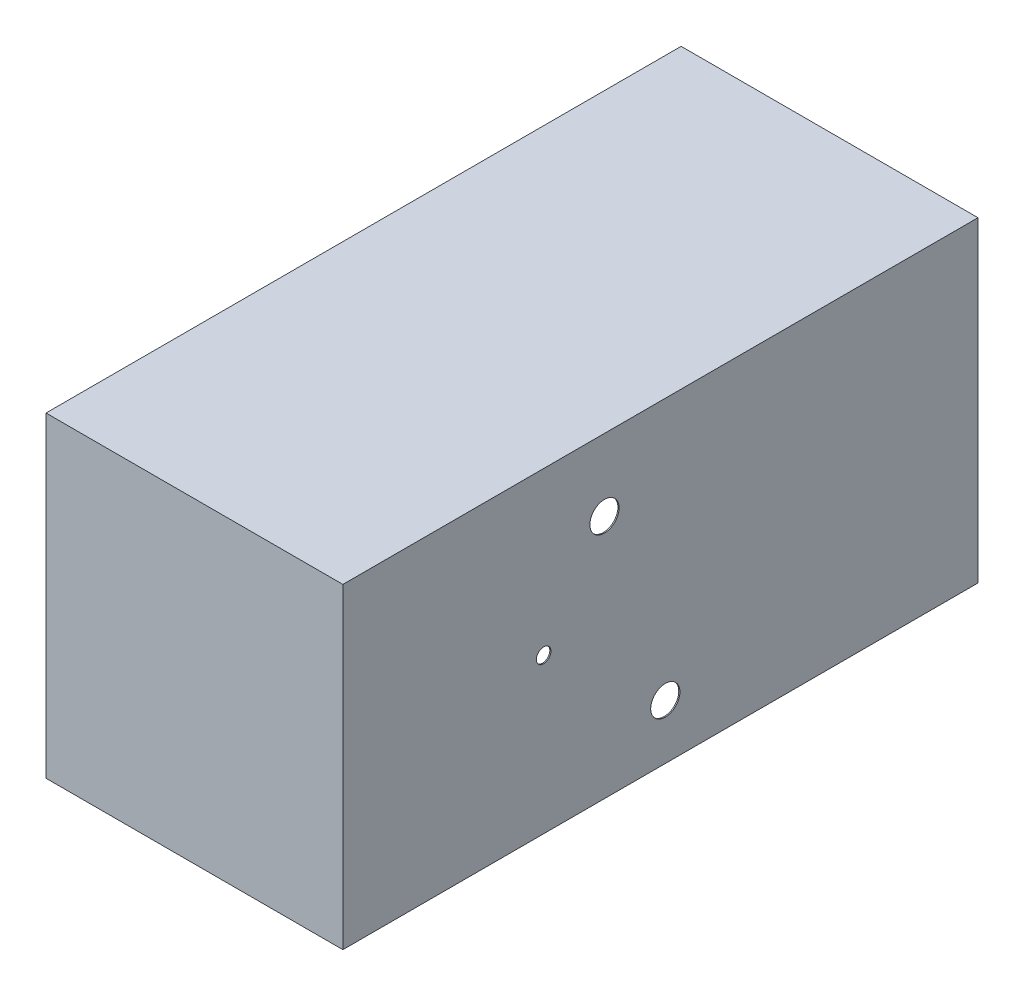
ISO-10303-21;
HEADER;
FILE_DESCRIPTION(('STEP AP214'),'2;1');
FILE_NAME('part.step','',(''),(''),'','','');
FILE_SCHEMA(('AUTOMOTIVE_DESIGN { 1 0 10303 214 1 1 1 1 }'));
ENDSEC;
DATA;
#1=APPLICATION_CONTEXT('core data for automotive mechanical design processes');
#2=APPLICATION_PROTOCOL_DEFINITION('international standard','automotive_design',2000,#1);
#3=PRODUCT_CONTEXT('',#1,'mechanical');
#4=PRODUCT('Part','Part','',(#3));
#5=PRODUCT_RELATED_PRODUCT_CATEGORY('part','',(#4));
#6=PRODUCT_DEFINITION_FORMATION('','',#4);
#7=PRODUCT_DEFINITION_CONTEXT('part definition',#1,'design');
#8=PRODUCT_DEFINITION('design','',#6,#7);
#9=PRODUCT_DEFINITION_SHAPE('','',#8);
#10=(LENGTH_UNIT() NAMED_UNIT(*) SI_UNIT(.MILLI.,.METRE.));
#11=(NAMED_UNIT(*) PLANE_ANGLE_UNIT() SI_UNIT($,.RADIAN.));
#12=(NAMED_UNIT(*) SI_UNIT($,.STERADIAN.) SOLID_ANGLE_UNIT());
#13=UNCERTAINTY_MEASURE_WITH_UNIT(LENGTH_MEASURE(1.E-05),#10,'distance_accuracy_value','');
#14=(GEOMETRIC_REPRESENTATION_CONTEXT(3) GLOBAL_UNCERTAINTY_ASSIGNED_CONTEXT((#13)) GLOBAL_UNIT_ASSIGNED_CONTEXT((#10,
#11,#12)) REPRESENTATION_CONTEXT('',''));
#15=CARTESIAN_POINT('',(0.,0.,0.));
#16=DIRECTION('',(0.,0.,1.));
#17=DIRECTION('',(1.,0.,0.));
#18=AXIS2_PLACEMENT_3D('',#15,#16,#17);
#19=CARTESIAN_POINT('',(0.,640.,-652.5));
#20=DIRECTION('',(0.,0.,1.));
#21=DIRECTION('',(1.,0.,0.));
#22=AXIS2_PLACEMENT_3D('',#19,#20,#21);
#23=PLANE('',#22);
#24=DIRECTION('',(-1.,0.,0.));
#25=VECTOR('',#24,1.);
#26=CARTESIAN_POINT('',(0.,0.,-652.5));
#27=LINE('',#26,#25);
#28=CARTESIAN_POINT('',(305.,0.,-652.5));
#29=VERTEX_POINT('',#28);
#30=CARTESIAN_POINT('',(-305.,0.,-652.5));
#31=VERTEX_POINT('',#30);
#32=EDGE_CURVE('E199',#29,#31,#27,.T.);
#33=ORIENTED_EDGE('',*,*,#32,.T.);
#34=DIRECTION('',(0.,-1.,0.));
#35=VECTOR('',#34,1.);
#36=CARTESIAN_POINT('',(-305.,640.,-652.5));
#37=LINE('',#36,#35);
#38=CARTESIAN_POINT('',(-305.,650.,-652.5));
#39=VERTEX_POINT('',#38);
#40=EDGE_CURVE('E11',#39,#31,#37,.T.);
#41=ORIENTED_EDGE('',*,*,#40,.F.);
#42=DIRECTION('',(-1.,0.,0.));
#43=VECTOR('',#42,1.);
#44=CARTESIAN_POINT('',(305.,650.,-652.5));
#45=LINE('',#44,#43);
#46=CARTESIAN_POINT('',(305.,650.,-652.5));
#47=VERTEX_POINT('',#46);
#48=EDGE_CURVE('E135',#47,#39,#45,.T.);
#49=ORIENTED_EDGE('',*,*,#48,.F.);
#50=DIRECTION('',(0.,-1.,0.));
#51=VECTOR('',#50,1.);
#52=CARTESIAN_POINT('',(305.,640.,-652.5));
#53=LINE('',#52,#51);
#54=EDGE_CURVE('E97',#47,#29,#53,.T.);
#55=ORIENTED_EDGE('',*,*,#54,.T.);
#56=EDGE_LOOP('',(#33,#41,#49,#55));
#57=FACE_BOUND('',#56,.T.);
#58=ADVANCED_FACE('F41',(#57),#23,.F.);
#59=CARTESIAN_POINT('',(-305.,640.,0.));
#60=DIRECTION('',(1.,0.,0.));
#61=DIRECTION('',(0.,0.,-1.));
#62=AXIS2_PLACEMENT_3D('',#59,#60,#61);
#63=PLANE('',#62);
#64=CARTESIAN_POINT('',(-305.,502.5,115.));
#65=DIRECTION('',(1.,0.,0.));
#66=DIRECTION('',(0.,0.,-1.));
#67=AXIS2_PLACEMENT_3D('',#64,#65,#66);
#68=CIRCLE('',#67,30.);
#69=CARTESIAN_POINT('',(-305.,502.5,85.0000000000001));
#70=VERTEX_POINT('',#69);
#71=EDGE_CURVE('E173',#70,#70,#68,.T.);
#72=ORIENTED_EDGE('',*,*,#71,.T.);
#73=EDGE_LOOP('',(#72));
#74=FACE_BOUND('',#73,.T.);
#75=CARTESIAN_POINT('',(-305.,112.5,-9.99999999999994));
#76=DIRECTION('',(1.,0.,0.));
#77=DIRECTION('',(0.,0.,-1.));
#78=AXIS2_PLACEMENT_3D('',#75,#76,#77);
#79=CIRCLE('',#78,30.);
#80=CARTESIAN_POINT('',(-305.,112.5,-39.9999999999999));
#81=VERTEX_POINT('',#80);
#82=EDGE_CURVE('E164',#81,#81,#79,.T.);
#83=ORIENTED_EDGE('',*,*,#82,.T.);
#84=EDGE_LOOP('',(#83));
#85=FACE_BOUND('',#84,.T.);
#86=CARTESIAN_POINT('',(-305.,317.5,240.));
#87=DIRECTION('',(1.,0.,0.));
#88=DIRECTION('',(0.,0.,-1.));
#89=AXIS2_PLACEMENT_3D('',#86,#87,#88);
#90=CIRCLE('',#89,15.);
#91=CARTESIAN_POINT('',(-305.,317.5,225.));
#92=VERTEX_POINT('',#91);
#93=EDGE_CURVE('E155',#92,#92,#90,.T.);
#94=ORIENTED_EDGE('',*,*,#93,.T.);
#95=EDGE_LOOP('',(#94));
#96=FACE_BOUND('',#95,.T.);
#97=DIRECTION('',(0.,0.,1.));
#98=VECTOR('',#97,1.);
#99=CARTESIAN_POINT('',(-305.,0.,0.));
#100=LINE('',#99,#98);
#101=CARTESIAN_POINT('',(-305.,0.,652.5));
#102=VERTEX_POINT('',#101);
#103=EDGE_CURVE('E122',#31,#102,#100,.T.);
#104=ORIENTED_EDGE('',*,*,#103,.T.);
#105=DIRECTION('',(0.,-1.,0.));
#106=VECTOR('',#105,1.);
#107=CARTESIAN_POINT('',(-305.,640.,652.5));
#108=LINE('',#107,#106);
#109=CARTESIAN_POINT('',(-305.,650.,652.5));
#110=VERTEX_POINT('',#109);
#111=EDGE_CURVE('E51',#110,#102,#108,.T.);
#112=ORIENTED_EDGE('',*,*,#111,.F.);
#113=DIRECTION('',(0.,0.,1.));
#114=VECTOR('',#113,1.);
#115=CARTESIAN_POINT('',(-305.,650.,-652.5));
#116=LINE('',#115,#114);
#117=EDGE_CURVE('E121',#39,#110,#116,.T.);
#118=ORIENTED_EDGE('',*,*,#117,.F.);
#119=ORIENTED_EDGE('',*,*,#40,.T.);
#120=EDGE_LOOP('',(#104,#112,#118,#119));
#121=FACE_BOUND('',#120,.T.);
#122=ADVANCED_FACE('F119',(#74,#85,#96,#121),#63,.F.);
#123=CARTESIAN_POINT('',(0.,640.,652.5));
#124=DIRECTION('',(0.,0.,1.));
#125=DIRECTION('',(1.,0.,0.));
#126=AXIS2_PLACEMENT_3D('',#123,#124,#125);
#127=PLANE('',#126);
#128=DIRECTION('',(-1.,0.,0.));
#129=VECTOR('',#128,1.);
#130=CARTESIAN_POINT('',(0.,0.,652.5));
#131=LINE('',#130,#129);
#132=CARTESIAN_POINT('',(305.,0.,652.5));
#133=VERTEX_POINT('',#132);
#134=EDGE_CURVE('E202',#133,#102,#131,.T.);
#135=ORIENTED_EDGE('',*,*,#134,.F.);
#136=DIRECTION('',(0.,-1.,0.));
#137=VECTOR('',#136,1.);
#138=CARTESIAN_POINT('',(305.,640.,652.5));
#139=LINE('',#138,#137);
#140=CARTESIAN_POINT('',(305.,650.,652.5));
#141=VERTEX_POINT('',#140);
#142=EDGE_CURVE('E90',#141,#133,#139,.T.);
#143=ORIENTED_EDGE('',*,*,#142,.F.);
#144=DIRECTION('',(1.,0.,0.));
#145=VECTOR('',#144,1.);
#146=CARTESIAN_POINT('',(305.,650.,652.5));
#147=LINE('',#146,#145);
#148=EDGE_CURVE('E127',#110,#141,#147,.T.);
#149=ORIENTED_EDGE('',*,*,#148,.F.);
#150=ORIENTED_EDGE('',*,*,#111,.T.);
#151=EDGE_LOOP('',(#135,#143,#149,#150));
#152=FACE_BOUND('',#151,.T.);
#153=ADVANCED_FACE('F128',(#152),#127,.T.);
#154=CARTESIAN_POINT('',(-302.662835249042,640.,0.));
#155=DIRECTION('',(1.,0.,0.));
#156=DIRECTION('',(0.,0.,-1.));
#157=AXIS2_PLACEMENT_3D('',#154,#155,#156);
#158=PLANE('',#157);
#159=CARTESIAN_POINT('',(-302.662835249042,502.5,115.));
#160=DIRECTION('',(1.,0.,0.));
#161=DIRECTION('',(0.,0.,-1.));
#162=AXIS2_PLACEMENT_3D('',#159,#160,#161);
#163=CIRCLE('',#162,30.);
#164=CARTESIAN_POINT('',(-302.662835249042,502.5,85.0000000000001));
#165=VERTEX_POINT('',#164);
#166=EDGE_CURVE('E170',#165,#165,#163,.T.);
#167=ORIENTED_EDGE('',*,*,#166,.F.);
#168=EDGE_LOOP('',(#167));
#169=FACE_BOUND('',#168,.T.);
#170=CARTESIAN_POINT('',(-302.662835249042,112.5,-9.99999999999994));
#171=DIRECTION('',(1.,0.,0.));
#172=DIRECTION('',(0.,0.,-1.));
#173=AXIS2_PLACEMENT_3D('',#170,#171,#172);
#174=CIRCLE('',#173,30.);
#175=CARTESIAN_POINT('',(-302.662835249042,112.5,-39.9999999999999));
#176=VERTEX_POINT('',#175);
#177=EDGE_CURVE('E161',#176,#176,#174,.T.);
#178=ORIENTED_EDGE('',*,*,#177,.F.);
#179=EDGE_LOOP('',(#178));
#180=FACE_BOUND('',#179,.T.);
#181=CARTESIAN_POINT('',(-302.662835249042,317.5,240.));
#182=DIRECTION('',(1.,0.,0.));
#183=DIRECTION('',(0.,0.,-1.));
#184=AXIS2_PLACEMENT_3D('',#181,#182,#183);
#185=CIRCLE('',#184,15.);
#186=CARTESIAN_POINT('',(-302.662835249042,317.5,225.));
#187=VERTEX_POINT('',#186);
#188=EDGE_CURVE('E152',#187,#187,#185,.T.);
#189=ORIENTED_EDGE('',*,*,#188,.F.);
#190=EDGE_LOOP('',(#189));
#191=FACE_BOUND('',#190,.T.);
#192=DIRECTION('',(0.,0.,1.));
#193=VECTOR('',#192,1.);
#194=CARTESIAN_POINT('',(-302.662835249042,0.,0.));
#195=LINE('',#194,#193);
#196=CARTESIAN_POINT('',(-302.662835249042,0.,-647.5));
#197=VERTEX_POINT('',#196);
#198=CARTESIAN_POINT('',(-302.662835249042,0.,647.5));
#199=VERTEX_POINT('',#198);
#200=EDGE_CURVE('E176',#197,#199,#195,.T.);
#201=ORIENTED_EDGE('',*,*,#200,.F.);
#202=DIRECTION('',(0.,-1.,0.));
#203=VECTOR('',#202,1.);
#204=CARTESIAN_POINT('',(-302.662835249042,640.,-647.5));
#205=LINE('',#204,#203);
#206=CARTESIAN_POINT('',(-302.662835249042,640.,-647.5));
#207=VERTEX_POINT('',#206);
#208=EDGE_CURVE('E45',#207,#197,#205,.T.);
#209=ORIENTED_EDGE('',*,*,#208,.F.);
#210=DIRECTION('',(0.,0.,1.));
#211=VECTOR('',#210,1.);
#212=CARTESIAN_POINT('',(-302.662835249042,640.,0.));
#213=LINE('',#212,#211);
#214=CARTESIAN_POINT('',(-302.662835249042,640.,647.5));
#215=VERTEX_POINT('',#214);
#216=EDGE_CURVE('E177',#207,#215,#213,.T.);
#217=ORIENTED_EDGE('',*,*,#216,.T.);
#218=DIRECTION('',(0.,-1.,0.));
#219=VECTOR('',#218,1.);
#220=CARTESIAN_POINT('',(-302.662835249042,640.,647.5));
#221=LINE('',#220,#219);
#222=EDGE_CURVE('E188',#215,#199,#221,.T.);
#223=ORIENTED_EDGE('',*,*,#222,.T.);
#224=EDGE_LOOP('',(#201,#209,#217,#223));
#225=FACE_BOUND('',#224,.T.);
#226=ADVANCED_FACE('F43',(#169,#180,#191,#225),#158,.T.);
#227=CARTESIAN_POINT('',(0.,640.,-647.5));
#228=DIRECTION('',(0.,0.,1.));
#229=DIRECTION('',(1.,0.,0.));
#230=AXIS2_PLACEMENT_3D('',#227,#228,#229);
#231=PLANE('',#230);
#232=DIRECTION('',(-1.,0.,0.));
#233=VECTOR('',#232,1.);
#234=CARTESIAN_POINT('',(0.,0.,-647.5));
#235=LINE('',#234,#233);
#236=CARTESIAN_POINT('',(302.662835249042,0.,-647.5));
#237=VERTEX_POINT('',#236);
#238=EDGE_CURVE('E191',#237,#197,#235,.T.);
#239=ORIENTED_EDGE('',*,*,#238,.F.);
#240=DIRECTION('',(0.,-1.,0.));
#241=VECTOR('',#240,1.);
#242=CARTESIAN_POINT('',(302.662835249042,640.,-647.5));
#243=LINE('',#242,#241);
#244=CARTESIAN_POINT('',(302.662835249042,640.,-647.5));
#245=VERTEX_POINT('',#244);
#246=EDGE_CURVE('E209',#245,#237,#243,.T.);
#247=ORIENTED_EDGE('',*,*,#246,.F.);
#248=DIRECTION('',(-1.,0.,0.));
#249=VECTOR('',#248,1.);
#250=CARTESIAN_POINT('',(0.,640.,-647.5));
#251=LINE('',#250,#249);
#252=EDGE_CURVE('E179',#245,#207,#251,.T.);
#253=ORIENTED_EDGE('',*,*,#252,.T.);
#254=ORIENTED_EDGE('',*,*,#208,.T.);
#255=EDGE_LOOP('',(#239,#247,#253,#254));
#256=FACE_BOUND('',#255,.T.);
#257=ADVANCED_FACE('F213',(#256),#231,.T.);
#258=CARTESIAN_POINT('',(302.662835249042,640.,0.));
#259=DIRECTION('',(1.,0.,0.));
#260=DIRECTION('',(0.,0.,-1.));
#261=AXIS2_PLACEMENT_3D('',#258,#259,#260);
#262=PLANE('',#261);
#263=CARTESIAN_POINT('',(302.662835249042,502.5,115.));
#264=DIRECTION('',(1.,0.,0.));
#265=DIRECTION('',(0.,0.,-1.));
#266=AXIS2_PLACEMENT_3D('',#263,#264,#265);
#267=CIRCLE('',#266,30.);
#268=CARTESIAN_POINT('',(302.662835249042,502.5,85.0000000000001));
#269=VERTEX_POINT('',#268);
#270=EDGE_CURVE('E167',#269,#269,#267,.T.);
#271=ORIENTED_EDGE('',*,*,#270,.T.);
#272=EDGE_LOOP('',(#271));
#273=FACE_BOUND('',#272,.T.);
#274=CARTESIAN_POINT('',(302.662835249042,112.5,-9.99999999999989));
#275=DIRECTION('',(1.,0.,0.));
#276=DIRECTION('',(0.,0.,-1.));
#277=AXIS2_PLACEMENT_3D('',#274,#275,#276);
#278=CIRCLE('',#277,30.);
#279=CARTESIAN_POINT('',(302.662835249042,112.5,-39.9999999999999));
#280=VERTEX_POINT('',#279);
#281=EDGE_CURVE('E158',#280,#280,#278,.T.);
#282=ORIENTED_EDGE('',*,*,#281,.T.);
#283=EDGE_LOOP('',(#282));
#284=FACE_BOUND('',#283,.T.);
#285=CARTESIAN_POINT('',(302.662835249042,317.5,240.));
#286=DIRECTION('',(1.,0.,0.));
#287=DIRECTION('',(0.,0.,-1.));
#288=AXIS2_PLACEMENT_3D('',#285,#286,#287);
#289=CIRCLE('',#288,15.);
#290=CARTESIAN_POINT('',(302.662835249042,317.5,225.));
#291=VERTEX_POINT('',#290);
#292=EDGE_CURVE('E144',#291,#291,#289,.T.);
#293=ORIENTED_EDGE('',*,*,#292,.T.);
#294=EDGE_LOOP('',(#293));
#295=FACE_BOUND('',#294,.T.);
#296=DIRECTION('',(0.,0.,1.));
#297=VECTOR('',#296,1.);
#298=CARTESIAN_POINT('',(302.662835249042,0.,0.));
#299=LINE('',#298,#297);
#300=CARTESIAN_POINT('',(302.662835249042,0.,647.5));
#301=VERTEX_POINT('',#300);
#302=EDGE_CURVE('E194',#237,#301,#299,.T.);
#303=ORIENTED_EDGE('',*,*,#302,.T.);
#304=DIRECTION('',(0.,-1.,0.));
#305=VECTOR('',#304,1.);
#306=CARTESIAN_POINT('',(302.662835249042,640.,647.5));
#307=LINE('',#306,#305);
#308=CARTESIAN_POINT('',(302.662835249042,640.,647.5));
#309=VERTEX_POINT('',#308);
#310=EDGE_CURVE('E60',#309,#301,#307,.T.);
#311=ORIENTED_EDGE('',*,*,#310,.F.);
#312=DIRECTION('',(0.,0.,1.));
#313=VECTOR('',#312,1.);
#314=CARTESIAN_POINT('',(302.662835249042,640.,0.));
#315=LINE('',#314,#313);
#316=EDGE_CURVE('E182',#245,#309,#315,.T.);
#317=ORIENTED_EDGE('',*,*,#316,.F.);
#318=ORIENTED_EDGE('',*,*,#246,.T.);
#319=EDGE_LOOP('',(#303,#311,#317,#318));
#320=FACE_BOUND('',#319,.T.);
#321=ADVANCED_FACE('F221',(#273,#284,#295,#320),#262,.F.);
#322=CARTESIAN_POINT('',(0.,640.,647.5));
#323=DIRECTION('',(0.,0.,1.));
#324=DIRECTION('',(1.,0.,0.));
#325=AXIS2_PLACEMENT_3D('',#322,#323,#324);
#326=PLANE('',#325);
#327=DIRECTION('',(-1.,0.,0.));
#328=VECTOR('',#327,1.);
#329=CARTESIAN_POINT('',(0.,0.,647.5));
#330=LINE('',#329,#328);
#331=EDGE_CURVE('E196',#301,#199,#330,.T.);
#332=ORIENTED_EDGE('',*,*,#331,.T.);
#333=ORIENTED_EDGE('',*,*,#222,.F.);
#334=DIRECTION('',(-1.,0.,0.));
#335=VECTOR('',#334,1.);
#336=CARTESIAN_POINT('',(0.,640.,647.5));
#337=LINE('',#336,#335);
#338=EDGE_CURVE('E185',#309,#215,#337,.T.);
#339=ORIENTED_EDGE('',*,*,#338,.F.);
#340=ORIENTED_EDGE('',*,*,#310,.T.);
#341=EDGE_LOOP('',(#332,#333,#339,#340));
#342=FACE_BOUND('',#341,.T.);
#343=ADVANCED_FACE('F223',(#342),#326,.F.);
#344=CARTESIAN_POINT('',(305.,640.,0.));
#345=DIRECTION('',(1.,0.,0.));
#346=DIRECTION('',(0.,0.,-1.));
#347=AXIS2_PLACEMENT_3D('',#344,#345,#346);
#348=PLANE('',#347);
#349=CARTESIAN_POINT('',(305.,502.5,115.));
#350=DIRECTION('',(1.,0.,0.));
#351=DIRECTION('',(0.,0.,-1.));
#352=AXIS2_PLACEMENT_3D('',#349,#350,#351);
#353=CIRCLE('',#352,30.);
#354=CARTESIAN_POINT('',(305.,502.5,85.0000000000001));
#355=VERTEX_POINT('',#354);
#356=EDGE_CURVE('E141',#355,#355,#353,.T.);
#357=ORIENTED_EDGE('',*,*,#356,.F.);
#358=EDGE_LOOP('',(#357));
#359=FACE_BOUND('',#358,.T.);
#360=CARTESIAN_POINT('',(305.,112.5,-9.99999999999988));
#361=DIRECTION('',(1.,0.,0.));
#362=DIRECTION('',(0.,0.,-1.));
#363=AXIS2_PLACEMENT_3D('',#360,#361,#362);
#364=CIRCLE('',#363,30.);
#365=CARTESIAN_POINT('',(305.,112.5,-39.9999999999999));
#366=VERTEX_POINT('',#365);
#367=EDGE_CURVE('E145',#366,#366,#364,.T.);
#368=ORIENTED_EDGE('',*,*,#367,.F.);
#369=EDGE_LOOP('',(#368));
#370=FACE_BOUND('',#369,.T.);
#371=CARTESIAN_POINT('',(305.,317.5,240.));
#372=DIRECTION('',(1.,0.,0.));
#373=DIRECTION('',(0.,0.,-1.));
#374=AXIS2_PLACEMENT_3D('',#371,#372,#373);
#375=CIRCLE('',#374,15.);
#376=CARTESIAN_POINT('',(305.,317.5,225.));
#377=VERTEX_POINT('',#376);
#378=EDGE_CURVE('E140',#377,#377,#375,.T.);
#379=ORIENTED_EDGE('',*,*,#378,.F.);
#380=EDGE_LOOP('',(#379));
#381=FACE_BOUND('',#380,.T.);
#382=DIRECTION('',(0.,0.,1.));
#383=VECTOR('',#382,1.);
#384=CARTESIAN_POINT('',(305.,0.,0.));
#385=LINE('',#384,#383);
#386=EDGE_CURVE('E180',#29,#133,#385,.T.);
#387=ORIENTED_EDGE('',*,*,#386,.F.);
#388=ORIENTED_EDGE('',*,*,#54,.F.);
#389=DIRECTION('',(0.,0.,-1.));
#390=VECTOR('',#389,1.);
#391=CARTESIAN_POINT('',(305.,650.,-652.5));
#392=LINE('',#391,#390);
#393=EDGE_CURVE('E131',#141,#47,#392,.T.);
#394=ORIENTED_EDGE('',*,*,#393,.F.);
#395=ORIENTED_EDGE('',*,*,#142,.T.);
#396=EDGE_LOOP('',(#387,#388,#394,#395));
#397=FACE_BOUND('',#396,.T.);
#398=ADVANCED_FACE('F249',(#359,#370,#381,#397),#348,.T.);
#399=CARTESIAN_POINT('',(0.,0.,0.));
#400=DIRECTION('',(0.,1.,0.));
#401=DIRECTION('',(0.,0.,1.));
#402=AXIS2_PLACEMENT_3D('',#399,#400,#401);
#403=PLANE('',#402);
#404=ORIENTED_EDGE('',*,*,#200,.T.);
#405=ORIENTED_EDGE('',*,*,#331,.F.);
#406=ORIENTED_EDGE('',*,*,#302,.F.);
#407=ORIENTED_EDGE('',*,*,#238,.T.);
#408=EDGE_LOOP('',(#404,#405,#406,#407));
#409=FACE_BOUND('',#408,.T.);
#410=ORIENTED_EDGE('',*,*,#32,.F.);
#411=ORIENTED_EDGE('',*,*,#386,.T.);
#412=ORIENTED_EDGE('',*,*,#134,.T.);
#413=ORIENTED_EDGE('',*,*,#103,.F.);
#414=EDGE_LOOP('',(#410,#411,#412,#413));
#415=FACE_BOUND('',#414,.T.);
#416=ADVANCED_FACE('F219',(#409,#415),#403,.F.);
#417=CARTESIAN_POINT('',(-335.,317.5,240.));
#418=DIRECTION('',(1.,0.,0.));
#419=DIRECTION('',(0.,0.,-1.));
#420=AXIS2_PLACEMENT_3D('',#417,#418,#419);
#421=CYLINDRICAL_SURFACE('',#420,15.);
#422=ORIENTED_EDGE('',*,*,#378,.T.);
#423=EDGE_LOOP('',(#422));
#424=FACE_BOUND('',#423,.T.);
#425=ORIENTED_EDGE('',*,*,#292,.F.);
#426=EDGE_LOOP('',(#425));
#427=FACE_BOUND('',#426,.T.);
#428=ADVANCED_FACE('F270',(#424,#427),#421,.F.);
#429=CARTESIAN_POINT('',(-335.,112.5,-9.99999999999994));
#430=DIRECTION('',(1.,0.,0.));
#431=DIRECTION('',(0.,0.,-1.));
#432=AXIS2_PLACEMENT_3D('',#429,#430,#431);
#433=CYLINDRICAL_SURFACE('',#432,30.);
#434=ORIENTED_EDGE('',*,*,#367,.T.);
#435=EDGE_LOOP('',(#434));
#436=FACE_BOUND('',#435,.T.);
#437=ORIENTED_EDGE('',*,*,#281,.F.);
#438=EDGE_LOOP('',(#437));
#439=FACE_BOUND('',#438,.T.);
#440=ADVANCED_FACE('F279',(#436,#439),#433,.F.);
#441=CARTESIAN_POINT('',(-335.,502.5,115.));
#442=DIRECTION('',(1.,0.,0.));
#443=DIRECTION('',(0.,0.,-1.));
#444=AXIS2_PLACEMENT_3D('',#441,#442,#443);
#445=CYLINDRICAL_SURFACE('',#444,30.);
#446=ORIENTED_EDGE('',*,*,#356,.T.);
#447=EDGE_LOOP('',(#446));
#448=FACE_BOUND('',#447,.T.);
#449=ORIENTED_EDGE('',*,*,#270,.F.);
#450=EDGE_LOOP('',(#449));
#451=FACE_BOUND('',#450,.T.);
#452=ADVANCED_FACE('F237',(#448,#451),#445,.F.);
#453=ORIENTED_EDGE('',*,*,#188,.T.);
#454=EDGE_LOOP('',(#453));
#455=FACE_BOUND('',#454,.T.);
#456=ORIENTED_EDGE('',*,*,#93,.F.);
#457=EDGE_LOOP('',(#456));
#458=FACE_BOUND('',#457,.T.);
#459=ADVANCED_FACE('F266',(#455,#458),#421,.F.);
#460=ORIENTED_EDGE('',*,*,#177,.T.);
#461=EDGE_LOOP('',(#460));
#462=FACE_BOUND('',#461,.T.);
#463=ORIENTED_EDGE('',*,*,#82,.F.);
#464=EDGE_LOOP('',(#463));
#465=FACE_BOUND('',#464,.T.);
#466=ADVANCED_FACE('F234',(#462,#465),#433,.F.);
#467=ORIENTED_EDGE('',*,*,#166,.T.);
#468=EDGE_LOOP('',(#467));
#469=FACE_BOUND('',#468,.T.);
#470=ORIENTED_EDGE('',*,*,#71,.F.);
#471=EDGE_LOOP('',(#470));
#472=FACE_BOUND('',#471,.T.);
#473=ADVANCED_FACE('F227',(#469,#472),#445,.F.);
#474=CARTESIAN_POINT('',(0.,640.,0.));
#475=DIRECTION('',(0.,-1.,0.));
#476=DIRECTION('',(0.,0.,-1.));
#477=AXIS2_PLACEMENT_3D('',#474,#475,#476);
#478=PLANE('',#477);
#479=ORIENTED_EDGE('',*,*,#216,.F.);
#480=ORIENTED_EDGE('',*,*,#252,.F.);
#481=ORIENTED_EDGE('',*,*,#316,.T.);
#482=ORIENTED_EDGE('',*,*,#338,.T.);
#483=EDGE_LOOP('',(#479,#480,#481,#482));
#484=FACE_BOUND('',#483,.T.);
#485=ADVANCED_FACE('F225',(#484),#478,.T.);
#486=CARTESIAN_POINT('',(0.,650.,0.));
#487=DIRECTION('',(0.,-1.,0.));
#488=DIRECTION('',(0.,0.,-1.));
#489=AXIS2_PLACEMENT_3D('',#486,#487,#488);
#490=PLANE('',#489);
#491=ORIENTED_EDGE('',*,*,#117,.T.);
#492=ORIENTED_EDGE('',*,*,#148,.T.);
#493=ORIENTED_EDGE('',*,*,#393,.T.);
#494=ORIENTED_EDGE('',*,*,#48,.T.);
#495=EDGE_LOOP('',(#491,#492,#493,#494));
#496=FACE_BOUND('',#495,.T.);
#497=ADVANCED_FACE('F134',(#496),#490,.F.);
#498=CLOSED_SHELL('',(#58,#122,#153,#226,#257,#321,#343,#398,#416,#428,#440,#452,#459,#466,#473,
#485,#497));
#499=MANIFOLD_SOLID_BREP('B2',#498);
#500=ADVANCED_BREP_SHAPE_REPRESENTATION('',(#18,#499),#14);
#501=SHAPE_DEFINITION_REPRESENTATION(#9,#500);
ENDSEC;
END-ISO-10303-21;
